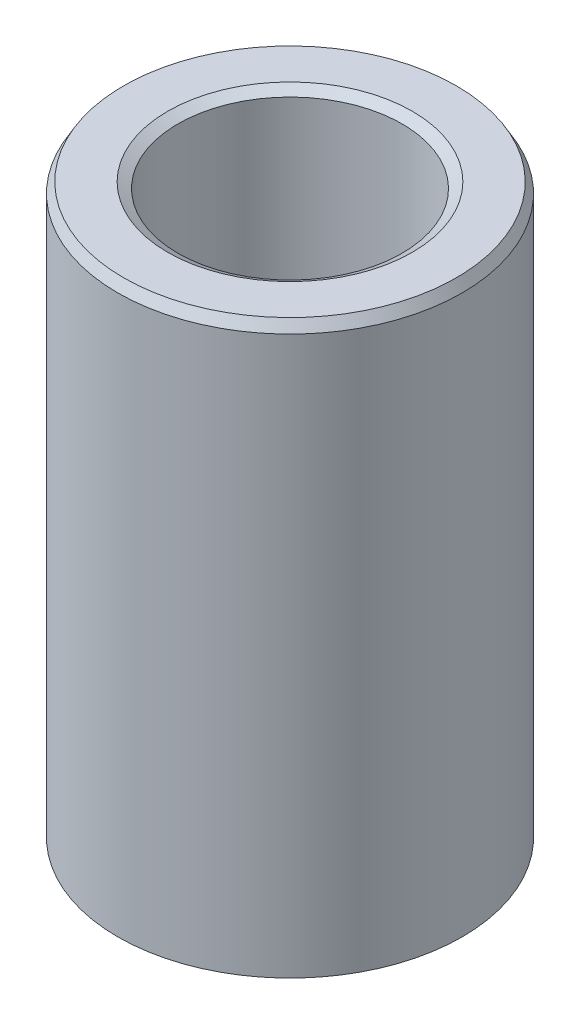
ISO-10303-21;
HEADER;
FILE_DESCRIPTION(('STEP AP214'),'2;1');
FILE_NAME('part.step','',(''),(''),'','','');
FILE_SCHEMA(('AUTOMOTIVE_DESIGN { 1 0 10303 214 1 1 1 1 }'));
ENDSEC;
DATA;
#1=APPLICATION_CONTEXT('core data for automotive mechanical design processes');
#2=APPLICATION_PROTOCOL_DEFINITION('international standard','automotive_design',2000,#1);
#3=PRODUCT_CONTEXT('',#1,'mechanical');
#4=PRODUCT('Part','Part','',(#3));
#5=PRODUCT_RELATED_PRODUCT_CATEGORY('part','',(#4));
#6=PRODUCT_DEFINITION_FORMATION('','',#4);
#7=PRODUCT_DEFINITION_CONTEXT('part definition',#1,'design');
#8=PRODUCT_DEFINITION('design','',#6,#7);
#9=PRODUCT_DEFINITION_SHAPE('','',#8);
#10=(LENGTH_UNIT() NAMED_UNIT(*) SI_UNIT(.MILLI.,.METRE.));
#11=(NAMED_UNIT(*) PLANE_ANGLE_UNIT() SI_UNIT($,.RADIAN.));
#12=(NAMED_UNIT(*) SI_UNIT($,.STERADIAN.) SOLID_ANGLE_UNIT());
#13=UNCERTAINTY_MEASURE_WITH_UNIT(LENGTH_MEASURE(1.E-05),#10,'distance_accuracy_value','');
#14=(GEOMETRIC_REPRESENTATION_CONTEXT(3) GLOBAL_UNCERTAINTY_ASSIGNED_CONTEXT((#13)) GLOBAL_UNIT_ASSIGNED_CONTEXT((#10,
#11,#12)) REPRESENTATION_CONTEXT('',''));
#15=CARTESIAN_POINT('',(0.,0.,0.));
#16=DIRECTION('',(0.,0.,1.));
#17=DIRECTION('',(1.,0.,0.));
#18=AXIS2_PLACEMENT_3D('',#15,#16,#17);
#19=CARTESIAN_POINT('',(0.,133.277725298275,0.));
#20=DIRECTION('',(0.,-1.,0.));
#21=DIRECTION('',(0.,0.,-1.));
#22=AXIS2_PLACEMENT_3D('',#19,#20,#21);
#23=CYLINDRICAL_SURFACE('',#22,40.);
#24=CARTESIAN_POINT('',(0.,1.36364416216828,0.));
#25=DIRECTION('',(0.,1.,0.));
#26=DIRECTION('',(0.,0.,1.));
#27=AXIS2_PLACEMENT_3D('',#24,#25,#26);
#28=CIRCLE('',#27,40.);
#29=CARTESIAN_POINT('',(0.,1.36364416216828,40.));
#30=VERTEX_POINT('',#29);
#31=EDGE_CURVE('E10',#30,#30,#28,.T.);
#32=ORIENTED_EDGE('',*,*,#31,.T.);
#33=EDGE_LOOP('',(#32));
#34=FACE_BOUND('',#33,.T.);
#35=CARTESIAN_POINT('',(0.,130.915824325955,0.));
#36=DIRECTION('',(0.,1.,0.));
#37=DIRECTION('',(0.,0.,1.));
#38=AXIS2_PLACEMENT_3D('',#35,#36,#37);
#39=CIRCLE('',#38,40.);
#40=CARTESIAN_POINT('',(0.,130.915824325955,40.));
#41=VERTEX_POINT('',#40);
#42=EDGE_CURVE('E50',#41,#41,#39,.F.);
#43=ORIENTED_EDGE('',*,*,#42,.T.);
#44=EDGE_LOOP('',(#43));
#45=FACE_BOUND('',#44,.T.);
#46=ADVANCED_FACE('F39',(#34,#45),#23,.T.);
#47=CARTESIAN_POINT('',(0.,133.277725298275,0.));
#48=DIRECTION('',(0.,1.,0.));
#49=DIRECTION('',(0.,0.,1.));
#50=AXIS2_PLACEMENT_3D('',#47,#48,#49);
#51=PLANE('',#50);
#52=CARTESIAN_POINT('',(0.,133.277725298275,0.));
#53=DIRECTION('',(0.,1.,0.));
#54=DIRECTION('',(0.,0.,1.));
#55=AXIS2_PLACEMENT_3D('',#52,#53,#54);
#56=CIRCLE('',#55,28.4011425002525);
#57=CARTESIAN_POINT('',(0.,133.277725298275,28.4011425002525));
#58=VERTEX_POINT('',#57);
#59=EDGE_CURVE('E58',#58,#58,#56,.F.);
#60=ORIENTED_EDGE('',*,*,#59,.T.);
#61=EDGE_LOOP('',(#60));
#62=FACE_BOUND('',#61,.T.);
#63=CARTESIAN_POINT('',(0.,133.277725298275,0.));
#64=DIRECTION('',(0.,1.,0.));
#65=DIRECTION('',(0.,0.,1.));
#66=AXIS2_PLACEMENT_3D('',#63,#64,#65);
#67=CIRCLE('',#66,38.6363558378317);
#68=CARTESIAN_POINT('',(0.,133.277725298275,38.6363558378317));
#69=VERTEX_POINT('',#68);
#70=EDGE_CURVE('E61',#69,#69,#67,.T.);
#71=ORIENTED_EDGE('',*,*,#70,.T.);
#72=EDGE_LOOP('',(#71));
#73=FACE_BOUND('',#72,.T.);
#74=ADVANCED_FACE('F88',(#62,#73),#51,.T.);
#75=CARTESIAN_POINT('',(0.,0.,0.));
#76=DIRECTION('',(0.,1.,0.));
#77=DIRECTION('',(0.,0.,1.));
#78=AXIS2_PLACEMENT_3D('',#75,#76,#77);
#79=PLANE('',#78);
#80=CARTESIAN_POINT('',(0.,0.,0.));
#81=DIRECTION('',(0.,1.,0.));
#82=DIRECTION('',(0.,0.,1.));
#83=AXIS2_PLACEMENT_3D('',#80,#81,#82);
#84=CIRCLE('',#83,27.4028856901006);
#85=CARTESIAN_POINT('',(0.,0.,27.4028856901006));
#86=VERTEX_POINT('',#85);
#87=EDGE_CURVE('E51',#86,#86,#84,.T.);
#88=ORIENTED_EDGE('',*,*,#87,.T.);
#89=EDGE_LOOP('',(#88));
#90=FACE_BOUND('',#89,.T.);
#91=CARTESIAN_POINT('',(0.,0.,0.));
#92=DIRECTION('',(0.,1.,0.));
#93=DIRECTION('',(0.,0.,1.));
#94=AXIS2_PLACEMENT_3D('',#91,#92,#93);
#95=CIRCLE('',#94,37.6380990276798);
#96=CARTESIAN_POINT('',(0.,0.,37.6380990276798));
#97=VERTEX_POINT('',#96);
#98=EDGE_CURVE('E54',#97,#97,#95,.F.);
#99=ORIENTED_EDGE('',*,*,#98,.T.);
#100=EDGE_LOOP('',(#99));
#101=FACE_BOUND('',#100,.T.);
#102=ADVANCED_FACE('F83',(#90,#101),#79,.F.);
#103=CARTESIAN_POINT('',(0.,133.277725298275,0.));
#104=DIRECTION('',(0.,-1.,0.));
#105=DIRECTION('',(0.,0.,-1.));
#106=AXIS2_PLACEMENT_3D('',#103,#104,#105);
#107=CYLINDRICAL_SURFACE('',#106,26.0392415279324);
#108=CARTESIAN_POINT('',(0.,131.914081136107,0.));
#109=DIRECTION('',(0.,1.,0.));
#110=DIRECTION('',(0.,0.,1.));
#111=AXIS2_PLACEMENT_3D('',#108,#109,#110);
#112=CIRCLE('',#111,26.0392415279324);
#113=CARTESIAN_POINT('',(0.,131.914081136107,26.0392415279323));
#114=VERTEX_POINT('',#113);
#115=EDGE_CURVE('E67',#114,#114,#112,.T.);
#116=ORIENTED_EDGE('',*,*,#115,.T.);
#117=EDGE_LOOP('',(#116));
#118=FACE_BOUND('',#117,.T.);
#119=CARTESIAN_POINT('',(0.,2.36190097232017,0.));
#120=DIRECTION('',(0.,1.,0.));
#121=DIRECTION('',(0.,0.,1.));
#122=AXIS2_PLACEMENT_3D('',#119,#120,#121);
#123=CIRCLE('',#122,26.0392415279324);
#124=CARTESIAN_POINT('',(0.,2.36190097232017,26.0392415279324));
#125=VERTEX_POINT('',#124);
#126=EDGE_CURVE('E69',#125,#125,#123,.F.);
#127=ORIENTED_EDGE('',*,*,#126,.T.);
#128=EDGE_LOOP('',(#127));
#129=FACE_BOUND('',#128,.T.);
#130=ADVANCED_FACE('F71',(#118,#129),#107,.F.);
#131=CARTESIAN_POINT('',(0.,131.914081136107,0.));
#132=DIRECTION('',(0.,1.,0.));
#133=DIRECTION('',(0.,0.,1.));
#134=AXIS2_PLACEMENT_3D('',#131,#132,#133);
#135=CONICAL_SURFACE('',#134,26.0392415279324,1.0471975511966);
#136=CARTESIAN_POINT('',(0.,133.277725298275,28.4011425002525));
#137=CARTESIAN_POINT('',(0.,133.263520671586,28.3765393651242));
#138=CARTESIAN_POINT('',(0.,133.249316044896,28.3519362299958));
#139=CARTESIAN_POINT('',(0.,133.220906791518,28.3027299597392));
#140=CARTESIAN_POINT('',(0.,133.206702164829,28.2781268246108));
#141=CARTESIAN_POINT('',(0.,133.17829291145,28.2289205543542));
#142=CARTESIAN_POINT('',(0.,133.164088284761,28.2043174192258));
#143=CARTESIAN_POINT('',(0.,133.135679031382,28.1551111489692));
#144=CARTESIAN_POINT('',(0.,133.121474404693,28.1305080138408));
#145=CARTESIAN_POINT('',(0.,133.093065151315,28.0813017435841));
#146=CARTESIAN_POINT('',(0.,133.078860524625,28.0566986084558));
#147=CARTESIAN_POINT('',(0.,133.050451271247,28.0074923381991));
#148=CARTESIAN_POINT('',(0.,133.036246644558,27.9828892030708));
#149=CARTESIAN_POINT('',(0.,133.007837391179,27.9336829328141));
#150=CARTESIAN_POINT('',(0.,132.99363276449,27.9090797976858));
#151=CARTESIAN_POINT('',(0.,132.965223511111,27.8598735274291));
#152=CARTESIAN_POINT('',(0.,132.951018884422,27.8352703923008));
#153=CARTESIAN_POINT('',(0.,132.922609631044,27.7860641220441));
#154=CARTESIAN_POINT('',(0.,132.908405004354,27.7614609869158));
#155=CARTESIAN_POINT('',(0.,132.879995750976,27.7122547166591));
#156=CARTESIAN_POINT('',(0.,132.865791124286,27.6876515815308));
#157=CARTESIAN_POINT('',(0.,132.837381870908,27.6384453112741));
#158=CARTESIAN_POINT('',(0.,132.823177244219,27.6138421761458));
#159=CARTESIAN_POINT('',(0.,132.79476799084,27.5646359058891));
#160=CARTESIAN_POINT('',(0.,132.780563364151,27.5400327707608));
#161=CARTESIAN_POINT('',(0.,132.752154110772,27.4908265005041));
#162=CARTESIAN_POINT('',(0.,132.737949484083,27.4662233653758));
#163=CARTESIAN_POINT('',(0.,132.709540230705,27.4170170951191));
#164=CARTESIAN_POINT('',(0.,132.695335604015,27.3924139599908));
#165=CARTESIAN_POINT('',(0.,132.666926350637,27.3432076897341));
#166=CARTESIAN_POINT('',(0.,132.652721723948,27.3186045546058));
#167=CARTESIAN_POINT('',(0.,132.624312470569,27.2693982843491));
#168=CARTESIAN_POINT('',(0.,132.61010784388,27.2447951492207));
#169=CARTESIAN_POINT('',(0.,132.581698590501,27.1955888789641));
#170=CARTESIAN_POINT('',(0.,132.567493963812,27.1709857438357));
#171=CARTESIAN_POINT('',(0.,132.539084710434,27.1217794735791));
#172=CARTESIAN_POINT('',(0.,132.524880083744,27.0971763384507));
#173=CARTESIAN_POINT('',(0.,132.496470830366,27.0479700681941));
#174=CARTESIAN_POINT('',(0.,132.482266203677,27.0233669330657));
#175=CARTESIAN_POINT('',(0.,132.453856950298,26.9741606628091));
#176=CARTESIAN_POINT('',(0.,132.439652323609,26.9495575276807));
#177=CARTESIAN_POINT('',(0.,132.41124307023,26.9003512574241));
#178=CARTESIAN_POINT('',(0.,132.397038443541,26.8757481222957));
#179=CARTESIAN_POINT('',(0.,132.368629190163,26.8265418520391));
#180=CARTESIAN_POINT('',(0.,132.354424563473,26.8019387169107));
#181=CARTESIAN_POINT('',(0.,132.326015310095,26.752732446654));
#182=CARTESIAN_POINT('',(0.,132.311810683406,26.7281293115257));
#183=CARTESIAN_POINT('',(0.,132.283401430027,26.678923041269));
#184=CARTESIAN_POINT('',(0.,132.269196803338,26.6543199061407));
#185=CARTESIAN_POINT('',(0.,132.240787549959,26.605113635884));
#186=CARTESIAN_POINT('',(0.,132.22658292327,26.5805105007557));
#187=CARTESIAN_POINT('',(0.,132.198173669892,26.531304230499));
#188=CARTESIAN_POINT('',(0.,132.183969043202,26.5067010953707));
#189=CARTESIAN_POINT('',(0.,132.155559789824,26.457494825114));
#190=CARTESIAN_POINT('',(0.,132.141355163135,26.4328916899857));
#191=CARTESIAN_POINT('',(0.,132.112945909756,26.383685419729));
#192=CARTESIAN_POINT('',(0.,132.098741283067,26.3590822846007));
#193=CARTESIAN_POINT('',(0.,132.070332029688,26.309876014344));
#194=CARTESIAN_POINT('',(0.,132.056127402999,26.2852728792157));
#195=CARTESIAN_POINT('',(0.,132.027718149621,26.236066608959));
#196=CARTESIAN_POINT('',(0.,132.013513522931,26.2114634738307));
#197=CARTESIAN_POINT('',(0.,131.985104269553,26.162257203574));
#198=CARTESIAN_POINT('',(0.,131.970899642864,26.1376540684457));
#199=CARTESIAN_POINT('',(0.,131.942490389485,26.088447798189));
#200=CARTESIAN_POINT('',(0.,131.928285762796,26.0638446630607));
#201=CARTESIAN_POINT('',(0.,131.914081136107,26.0392415279323));
#202=B_SPLINE_CURVE_WITH_KNOTS('',3,(#136,#137,#138,#139,#140,#141,#142,#143,#144,#145,#146,
#147,#148,#149,#150,#151,#152,#153,#154,#155,#156,#157,#158,#159,#160,#161,#162,#163,#164,#165,
#166,#167,#168,#169,#170,#171,#172,#173,#174,#175,#176,#177,#178,#179,#180,#181,#182,#183,#184,
#185,#186,#187,#188,#189,#190,#191,#192,#193,#194,#195,#196,#197,#198,#199,#200,#201),
.UNSPECIFIED.,.F.,.F.,(4,2,2,2,2,2,2,2,2,2,2,2,2,2,2,2,2,2,2,2,2,2,2,2,2,2,2,2,2,2,2,2,4),(0.,
0.0852277601355205,0.170455520271041,0.255683280406562,0.340911040542071,0.426138800677592,
0.511366560813112,0.596594320948633,0.681822081084143,0.767049841219663,0.852277601355184,
0.937505361490707,1.02273312162621,1.10796088176173,1.19318864189725,1.27841640203278,
1.36364416216828,1.44887192230381,1.53409968243933,1.61932744257485,1.70455520271036,
1.78978296284588,1.8750107229814,1.96023848311692,2.04546624325244,2.13069400338795,
2.21592176352347,2.30114952365899,2.38637728379451,2.47160504393002,2.55683280406554,
2.64206056420106,2.72728832433657),.UNSPECIFIED.);
#203=EDGE_CURVE('BSEAM77',#58,#114,#202,.T.);
#204=ORIENTED_EDGE('',*,*,#59,.F.);
#205=ORIENTED_EDGE('',*,*,#115,.F.);
#206=ORIENTED_EDGE('',*,*,#203,.T.);
#207=ORIENTED_EDGE('',*,*,#203,.F.);
#208=EDGE_LOOP('',(#204,#206,#205,#207));
#209=FACE_BOUND('',#208,.T.);
#210=ADVANCED_FACE('F77',(#209),#135,.F.);
#211=CARTESIAN_POINT('',(0.,0.,0.));
#212=DIRECTION('',(0.,-1.,0.));
#213=DIRECTION('',(0.,0.,-1.));
#214=AXIS2_PLACEMENT_3D('',#211,#212,#213);
#215=CONICAL_SURFACE('',#214,27.4028856901006,0.523598775598297);
#216=ORIENTED_EDGE('',*,*,#126,.F.);
#217=EDGE_LOOP('',(#216));
#218=FACE_BOUND('',#217,.T.);
#219=ORIENTED_EDGE('',*,*,#87,.F.);
#220=EDGE_LOOP('',(#219));
#221=FACE_BOUND('',#220,.T.);
#222=ADVANCED_FACE('F73',(#218,#221),#215,.F.);
#223=CARTESIAN_POINT('',(0.,1.36364416216828,0.));
#224=DIRECTION('',(0.,1.,0.));
#225=DIRECTION('',(0.,0.,1.));
#226=AXIS2_PLACEMENT_3D('',#223,#224,#225);
#227=CONICAL_SURFACE('',#226,40.,1.0471975511966);
#228=CARTESIAN_POINT('',(0.,0.,37.6380990276798));
#229=CARTESIAN_POINT('',(0.,0.0142046266892526,37.6627021628082));
#230=CARTESIAN_POINT('',(0.,0.0284092533785055,37.6873052979365));
#231=CARTESIAN_POINT('',(0.,0.0568185067570113,37.7365115681932));
#232=CARTESIAN_POINT('',(0.,0.0710231334462642,37.7611147033215));
#233=CARTESIAN_POINT('',(0.,0.0994323868247698,37.8103209735782));
#234=CARTESIAN_POINT('',(0.,0.113637013514023,37.8349241087065));
#235=CARTESIAN_POINT('',(0.,0.142046266892529,37.8841303789632));
#236=CARTESIAN_POINT('',(0.,0.156250893581782,37.9087335140915));
#237=CARTESIAN_POINT('',(0.,0.184660146960288,37.9579397843482));
#238=CARTESIAN_POINT('',(0.,0.19886477364954,37.9825429194765));
#239=CARTESIAN_POINT('',(0.,0.227274027028045,38.0317491897332));
#240=CARTESIAN_POINT('',(0.,0.241478653717298,38.0563523248615));
#241=CARTESIAN_POINT('',(0.,0.269887907095805,38.1055585951182));
#242=CARTESIAN_POINT('',(0.,0.284092533785057,38.1301617302465));
#243=CARTESIAN_POINT('',(0.,0.312501787163563,38.1793680005032));
#244=CARTESIAN_POINT('',(0.,0.326706413852816,38.2039711356315));
#245=CARTESIAN_POINT('',(0.,0.355115667231322,38.2531774058882));
#246=CARTESIAN_POINT('',(0.,0.369320293920575,38.2777805410165));
#247=CARTESIAN_POINT('',(0.,0.397729547299081,38.3269868112732));
#248=CARTESIAN_POINT('',(0.,0.411934173988333,38.3515899464015));
#249=CARTESIAN_POINT('',(0.,0.440343427366838,38.4007962166582));
#250=CARTESIAN_POINT('',(0.,0.454548054056092,38.4253993517866));
#251=CARTESIAN_POINT('',(0.,0.482957307434598,38.4746056220432));
#252=CARTESIAN_POINT('',(0.,0.497161934123851,38.4992087571716));
#253=CARTESIAN_POINT('',(0.,0.525571187502356,38.5484150274282));
#254=CARTESIAN_POINT('',(0.,0.539775814191609,38.5730181625566));
#255=CARTESIAN_POINT('',(0.,0.568185067570115,38.6222244328132));
#256=CARTESIAN_POINT('',(0.,0.582389694259368,38.6468275679416));
#257=CARTESIAN_POINT('',(0.,0.610798947637874,38.6960338381982));
#258=CARTESIAN_POINT('',(0.,0.625003574327126,38.7206369733266));
#259=CARTESIAN_POINT('',(0.,0.653412827705632,38.7698432435832));
#260=CARTESIAN_POINT('',(0.,0.667617454394886,38.7944463787116));
#261=CARTESIAN_POINT('',(0.,0.696026707773391,38.8436526489682));
#262=CARTESIAN_POINT('',(0.,0.710231334462643,38.8682557840966));
#263=CARTESIAN_POINT('',(0.,0.738640587841149,38.9174620543533));
#264=CARTESIAN_POINT('',(0.,0.752845214530402,38.9420651894816));
#265=CARTESIAN_POINT('',(0.,0.781254467908908,38.9912714597383));
#266=CARTESIAN_POINT('',(0.,0.795459094598161,39.0158745948666));
#267=CARTESIAN_POINT('',(0.,0.823868347976667,39.0650808651233));
#268=CARTESIAN_POINT('',(0.,0.83807297466592,39.0896840002516));
#269=CARTESIAN_POINT('',(0.,0.866482228044425,39.1388902705083));
#270=CARTESIAN_POINT('',(0.,0.880686854733678,39.1634934056366));
#271=CARTESIAN_POINT('',(0.,0.909096108112184,39.2126996758933));
#272=CARTESIAN_POINT('',(0.,0.923300734801437,39.2373028110216));
#273=CARTESIAN_POINT('',(0.,0.951709988179943,39.2865090812783));
#274=CARTESIAN_POINT('',(0.,0.965914614869195,39.3111122164066));
#275=CARTESIAN_POINT('',(0.,0.9943238682477,39.3603184866633));
#276=CARTESIAN_POINT('',(0.,1.00852849493695,39.3849216217916));
#277=CARTESIAN_POINT('',(0.,1.03693774831546,39.4341278920483));
#278=CARTESIAN_POINT('',(0.,1.05114237500471,39.4587310271766));
#279=CARTESIAN_POINT('',(0.,1.07955162838322,39.5079372974333));
#280=CARTESIAN_POINT('',(0.,1.09375625507247,39.5325404325616));
#281=CARTESIAN_POINT('',(0.,1.12216550845098,39.5817467028183));
#282=CARTESIAN_POINT('',(0.,1.13637013514023,39.6063498379466));
#283=CARTESIAN_POINT('',(0.,1.16477938851874,39.6555561082033));
#284=CARTESIAN_POINT('',(0.,1.17898401520799,39.6801592433316));
#285=CARTESIAN_POINT('',(0.,1.20739326858649,39.7293655135883));
#286=CARTESIAN_POINT('',(0.,1.22159789527575,39.7539686487167));
#287=CARTESIAN_POINT('',(0.,1.25000714865425,39.8031749189733));
#288=CARTESIAN_POINT('',(0.,1.26421177534351,39.8277780541017));
#289=CARTESIAN_POINT('',(0.,1.29262102872201,39.8769843243583));
#290=CARTESIAN_POINT('',(0.,1.30682565541126,39.9015874594867));
#291=CARTESIAN_POINT('',(0.,1.33523490878977,39.9507937297433));
#292=CARTESIAN_POINT('',(0.,1.34943953547902,39.9753968648717));
#293=CARTESIAN_POINT('',(0.,1.36364416216828,40.));
#294=B_SPLINE_CURVE_WITH_KNOTS('',3,(#228,#229,#230,#231,#232,#233,#234,#235,#236,#237,#238,
#239,#240,#241,#242,#243,#244,#245,#246,#247,#248,#249,#250,#251,#252,#253,#254,#255,#256,#257,
#258,#259,#260,#261,#262,#263,#264,#265,#266,#267,#268,#269,#270,#271,#272,#273,#274,#275,#276,
#277,#278,#279,#280,#281,#282,#283,#284,#285,#286,#287,#288,#289,#290,#291,#292,#293),
.UNSPECIFIED.,.F.,.F.,(4,2,2,2,2,2,2,2,2,2,2,2,2,2,2,2,2,2,2,2,2,2,2,2,2,2,2,2,2,2,2,2,4),(0.,
0.0852277601355171,0.170455520271034,0.255683280406551,0.340911040542068,0.426138800677591,
0.511366560813108,0.596594320948626,0.681822081084143,0.76704984121966,0.852277601355183,
0.9375053614907,1.02273312162622,1.10796088176173,1.19318864189725,1.27841640203277,
1.36364416216829,1.44887192230381,1.53409968243933,1.61932744257484,1.70455520271036,
1.78978296284588,1.87501072298139,1.96023848311692,2.04546624325243,2.13069400338795,
2.21592176352347,2.30114952365899,2.3863772837945,2.47160504393003,2.55683280406554,
2.64206056420106,2.72728832433658),.UNSPECIFIED.);
#295=EDGE_CURVE('BSEAM76',#97,#30,#294,.T.);
#296=ORIENTED_EDGE('',*,*,#98,.F.);
#297=ORIENTED_EDGE('',*,*,#31,.F.);
#298=ORIENTED_EDGE('',*,*,#295,.T.);
#299=ORIENTED_EDGE('',*,*,#295,.F.);
#300=EDGE_LOOP('',(#296,#298,#297,#299));
#301=FACE_BOUND('',#300,.T.);
#302=ADVANCED_FACE('F76',(#301),#227,.T.);
#303=CARTESIAN_POINT('',(0.,133.277725298275,0.));
#304=DIRECTION('',(0.,-1.,0.));
#305=DIRECTION('',(0.,0.,-1.));
#306=AXIS2_PLACEMENT_3D('',#303,#304,#305);
#307=CONICAL_SURFACE('',#306,38.6363558378317,0.523598775598293);
#308=ORIENTED_EDGE('',*,*,#42,.F.);
#309=EDGE_LOOP('',(#308));
#310=FACE_BOUND('',#309,.T.);
#311=ORIENTED_EDGE('',*,*,#70,.F.);
#312=EDGE_LOOP('',(#311));
#313=FACE_BOUND('',#312,.T.);
#314=ADVANCED_FACE('F45',(#310,#313),#307,.T.);
#315=CLOSED_SHELL('',(#46,#74,#102,#130,#210,#222,#302,#314));
#316=MANIFOLD_SOLID_BREP('B2',#315);
#317=ADVANCED_BREP_SHAPE_REPRESENTATION('',(#18,#316),#14);
#318=SHAPE_DEFINITION_REPRESENTATION(#9,#317);
ENDSEC;
END-ISO-10303-21;
